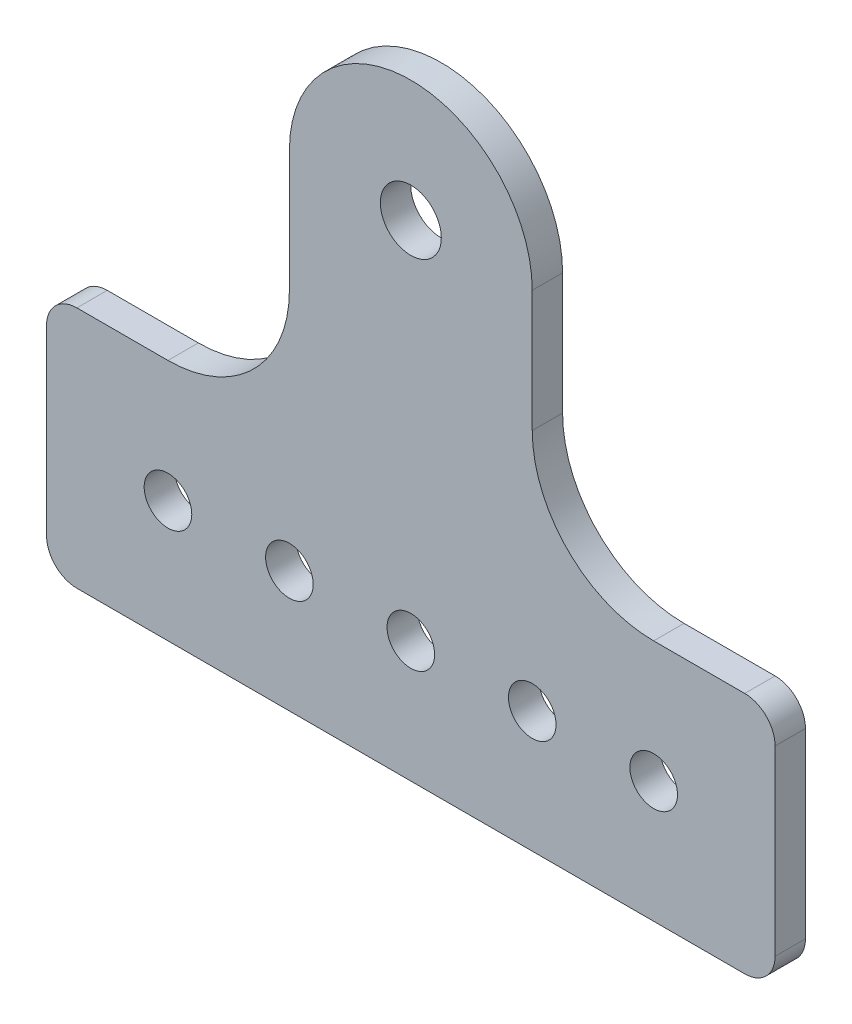
ISO-10303-21;
HEADER;
FILE_DESCRIPTION(('STEP AP214'),'2;1');
FILE_NAME('part.step','',(''),(''),'','','');
FILE_SCHEMA(('AUTOMOTIVE_DESIGN { 1 0 10303 214 1 1 1 1 }'));
ENDSEC;
DATA;
#1=APPLICATION_CONTEXT('core data for automotive mechanical design processes');
#2=APPLICATION_PROTOCOL_DEFINITION('international standard','automotive_design',2000,#1);
#3=PRODUCT_CONTEXT('',#1,'mechanical');
#4=PRODUCT('Part','Part','',(#3));
#5=PRODUCT_RELATED_PRODUCT_CATEGORY('part','',(#4));
#6=PRODUCT_DEFINITION_FORMATION('','',#4);
#7=PRODUCT_DEFINITION_CONTEXT('part definition',#1,'design');
#8=PRODUCT_DEFINITION('design','',#6,#7);
#9=PRODUCT_DEFINITION_SHAPE('','',#8);
#10=(LENGTH_UNIT() NAMED_UNIT(*) SI_UNIT(.MILLI.,.METRE.));
#11=(NAMED_UNIT(*) PLANE_ANGLE_UNIT() SI_UNIT($,.RADIAN.));
#12=(NAMED_UNIT(*) SI_UNIT($,.STERADIAN.) SOLID_ANGLE_UNIT());
#13=UNCERTAINTY_MEASURE_WITH_UNIT(LENGTH_MEASURE(1.E-05),#10,'distance_accuracy_value','');
#14=(GEOMETRIC_REPRESENTATION_CONTEXT(3) GLOBAL_UNCERTAINTY_ASSIGNED_CONTEXT((#13)) GLOBAL_UNIT_ASSIGNED_CONTEXT((#10,
#11,#12)) REPRESENTATION_CONTEXT('',''));
#15=CARTESIAN_POINT('',(0.,0.,0.));
#16=DIRECTION('',(0.,0.,1.));
#17=DIRECTION('',(1.,0.,0.));
#18=AXIS2_PLACEMENT_3D('',#15,#16,#17);
#19=CARTESIAN_POINT('',(0.,24.8227272727273,3.175));
#20=DIRECTION('',(0.,0.,1.));
#21=DIRECTION('',(1.,0.,0.));
#22=AXIS2_PLACEMENT_3D('',#19,#20,#21);
#23=PLANE('',#22);
#24=CARTESIAN_POINT('',(0.,50.8,3.175));
#25=DIRECTION('',(0.,0.,1.));
#26=DIRECTION('',(1.,0.,0.));
#27=AXIS2_PLACEMENT_3D('',#24,#25,#26);
#28=CIRCLE('',#27,3.1877);
#29=CARTESIAN_POINT('',(3.18769999999999,50.8,3.175));
#30=VERTEX_POINT('',#29);
#31=EDGE_CURVE('E201',#30,#30,#28,.F.);
#32=ORIENTED_EDGE('',*,*,#31,.T.);
#33=EDGE_LOOP('',(#32));
#34=FACE_BOUND('',#33,.T.);
#35=CARTESIAN_POINT('',(25.4,12.7,3.175));
#36=DIRECTION('',(0.,0.,1.));
#37=DIRECTION('',(1.,0.,0.));
#38=AXIS2_PLACEMENT_3D('',#35,#36,#37);
#39=CIRCLE('',#38,2.4892);
#40=CARTESIAN_POINT('',(27.8892,12.7,3.175));
#41=VERTEX_POINT('',#40);
#42=EDGE_CURVE('E204',#41,#41,#39,.F.);
#43=ORIENTED_EDGE('',*,*,#42,.T.);
#44=EDGE_LOOP('',(#43));
#45=FACE_BOUND('',#44,.T.);
#46=CARTESIAN_POINT('',(0.,12.7,3.175));
#47=DIRECTION('',(0.,0.,1.));
#48=DIRECTION('',(1.,0.,0.));
#49=AXIS2_PLACEMENT_3D('',#46,#47,#48);
#50=CIRCLE('',#49,2.4892);
#51=CARTESIAN_POINT('',(2.4892,12.7,3.175));
#52=VERTEX_POINT('',#51);
#53=EDGE_CURVE('E207',#52,#52,#50,.F.);
#54=ORIENTED_EDGE('',*,*,#53,.T.);
#55=EDGE_LOOP('',(#54));
#56=FACE_BOUND('',#55,.T.);
#57=CARTESIAN_POINT('',(-25.4,12.7,3.175));
#58=DIRECTION('',(0.,0.,1.));
#59=DIRECTION('',(1.,0.,0.));
#60=AXIS2_PLACEMENT_3D('',#57,#58,#59);
#61=CIRCLE('',#60,2.4892);
#62=CARTESIAN_POINT('',(-22.9108,12.7,3.175));
#63=VERTEX_POINT('',#62);
#64=EDGE_CURVE('E210',#63,#63,#61,.F.);
#65=ORIENTED_EDGE('',*,*,#64,.T.);
#66=EDGE_LOOP('',(#65));
#67=FACE_BOUND('',#66,.T.);
#68=CARTESIAN_POINT('',(-12.7,12.7,3.175));
#69=DIRECTION('',(0.,0.,1.));
#70=DIRECTION('',(1.,0.,0.));
#71=AXIS2_PLACEMENT_3D('',#68,#69,#70);
#72=CIRCLE('',#71,2.4892);
#73=CARTESIAN_POINT('',(-10.2108,12.7,3.175));
#74=VERTEX_POINT('',#73);
#75=EDGE_CURVE('E213',#74,#74,#72,.F.);
#76=ORIENTED_EDGE('',*,*,#75,.T.);
#77=EDGE_LOOP('',(#76));
#78=FACE_BOUND('',#77,.T.);
#79=CARTESIAN_POINT('',(12.7,12.7,3.175));
#80=DIRECTION('',(0.,0.,1.));
#81=DIRECTION('',(1.,0.,0.));
#82=AXIS2_PLACEMENT_3D('',#79,#80,#81);
#83=CIRCLE('',#82,2.4892);
#84=CARTESIAN_POINT('',(15.1892,12.7,3.175));
#85=VERTEX_POINT('',#84);
#86=EDGE_CURVE('E216',#85,#85,#83,.F.);
#87=ORIENTED_EDGE('',*,*,#86,.T.);
#88=EDGE_LOOP('',(#87));
#89=FACE_BOUND('',#88,.T.);
#90=CARTESIAN_POINT('',(25.4,38.1,3.175));
#91=DIRECTION('',(0.,0.,1.));
#92=DIRECTION('',(1.,0.,0.));
#93=AXIS2_PLACEMENT_3D('',#90,#91,#92);
#94=CIRCLE('',#93,12.7);
#95=CARTESIAN_POINT('',(25.4,25.4,3.175));
#96=VERTEX_POINT('',#95);
#97=CARTESIAN_POINT('',(12.7,38.1,3.175));
#98=VERTEX_POINT('',#97);
#99=EDGE_CURVE('E221',#96,#98,#94,.F.);
#100=ORIENTED_EDGE('',*,*,#99,.T.);
#101=DIRECTION('',(0.,1.,0.));
#102=VECTOR('',#101,1.);
#103=CARTESIAN_POINT('',(12.7,25.4,3.175));
#104=LINE('',#103,#102);
#105=CARTESIAN_POINT('',(12.7,50.8,3.175));
#106=VERTEX_POINT('',#105);
#107=EDGE_CURVE('E142',#106,#98,#104,.F.);
#108=ORIENTED_EDGE('',*,*,#107,.F.);
#109=CARTESIAN_POINT('',(0.,50.8,3.175));
#110=DIRECTION('',(0.,0.,1.));
#111=DIRECTION('',(1.,0.,0.));
#112=AXIS2_PLACEMENT_3D('',#109,#110,#111);
#113=CIRCLE('',#112,12.7);
#114=CARTESIAN_POINT('',(-12.7,50.8,3.175));
#115=VERTEX_POINT('',#114);
#116=EDGE_CURVE('E145',#115,#106,#113,.F.);
#117=ORIENTED_EDGE('',*,*,#116,.F.);
#118=DIRECTION('',(0.,-1.,0.));
#119=VECTOR('',#118,1.);
#120=CARTESIAN_POINT('',(-12.7,63.5,3.175));
#121=LINE('',#120,#119);
#122=CARTESIAN_POINT('',(-12.7,38.1,3.175));
#123=VERTEX_POINT('',#122);
#124=EDGE_CURVE('E113',#123,#115,#121,.F.);
#125=ORIENTED_EDGE('',*,*,#124,.F.);
#126=CARTESIAN_POINT('',(-25.4,38.1,3.175));
#127=DIRECTION('',(0.,0.,1.));
#128=DIRECTION('',(1.,0.,0.));
#129=AXIS2_PLACEMENT_3D('',#126,#127,#128);
#130=CIRCLE('',#129,12.7);
#131=CARTESIAN_POINT('',(-25.4,25.4,3.175));
#132=VERTEX_POINT('',#131);
#133=EDGE_CURVE('E18',#123,#132,#130,.F.);
#134=ORIENTED_EDGE('',*,*,#133,.T.);
#135=DIRECTION('',(-1.,0.,0.));
#136=VECTOR('',#135,1.);
#137=CARTESIAN_POINT('',(-12.7,25.4,3.175));
#138=LINE('',#137,#136);
#139=CARTESIAN_POINT('',(-34.925,25.4,3.175));
#140=VERTEX_POINT('',#139);
#141=EDGE_CURVE('E118',#140,#132,#138,.F.);
#142=ORIENTED_EDGE('',*,*,#141,.F.);
#143=CARTESIAN_POINT('',(-34.925,22.225,3.175));
#144=DIRECTION('',(0.,0.,1.));
#145=DIRECTION('',(1.,0.,0.));
#146=AXIS2_PLACEMENT_3D('',#143,#144,#145);
#147=CIRCLE('',#146,3.175);
#148=CARTESIAN_POINT('',(-38.1,22.225,3.175));
#149=VERTEX_POINT('',#148);
#150=EDGE_CURVE('E130',#149,#140,#147,.F.);
#151=ORIENTED_EDGE('',*,*,#150,.F.);
#152=DIRECTION('',(0.,-1.,0.));
#153=VECTOR('',#152,1.);
#154=CARTESIAN_POINT('',(-38.1,25.4,3.175));
#155=LINE('',#154,#153);
#156=CARTESIAN_POINT('',(-38.1,3.175,3.175));
#157=VERTEX_POINT('',#156);
#158=EDGE_CURVE('E159',#157,#149,#155,.F.);
#159=ORIENTED_EDGE('',*,*,#158,.F.);
#160=CARTESIAN_POINT('',(-34.925,3.175,3.175));
#161=DIRECTION('',(0.,0.,1.));
#162=DIRECTION('',(1.,0.,0.));
#163=AXIS2_PLACEMENT_3D('',#160,#161,#162);
#164=CIRCLE('',#163,3.175);
#165=CARTESIAN_POINT('',(-34.925,0.,3.175));
#166=VERTEX_POINT('',#165);
#167=EDGE_CURVE('E228',#166,#157,#164,.F.);
#168=ORIENTED_EDGE('',*,*,#167,.F.);
#169=DIRECTION('',(1.,0.,0.));
#170=VECTOR('',#169,1.);
#171=CARTESIAN_POINT('',(-38.1,0.,3.175));
#172=LINE('',#171,#170);
#173=CARTESIAN_POINT('',(34.925,0.,3.175));
#174=VERTEX_POINT('',#173);
#175=EDGE_CURVE('E155',#174,#166,#172,.F.);
#176=ORIENTED_EDGE('',*,*,#175,.F.);
#177=CARTESIAN_POINT('',(34.925,3.17500000000003,3.175));
#178=DIRECTION('',(0.,0.,1.));
#179=DIRECTION('',(1.,0.,0.));
#180=AXIS2_PLACEMENT_3D('',#177,#178,#179);
#181=CIRCLE('',#180,3.175);
#182=CARTESIAN_POINT('',(38.1,3.17500000000003,3.175));
#183=VERTEX_POINT('',#182);
#184=EDGE_CURVE('E226',#183,#174,#181,.F.);
#185=ORIENTED_EDGE('',*,*,#184,.F.);
#186=DIRECTION('',(0.,1.,0.));
#187=VECTOR('',#186,1.);
#188=CARTESIAN_POINT('',(38.1,0.,3.175));
#189=LINE('',#188,#187);
#190=CARTESIAN_POINT('',(38.1,22.225,3.175));
#191=VERTEX_POINT('',#190);
#192=EDGE_CURVE('E151',#191,#183,#189,.F.);
#193=ORIENTED_EDGE('',*,*,#192,.F.);
#194=CARTESIAN_POINT('',(34.925,22.225,3.175));
#195=DIRECTION('',(0.,0.,1.));
#196=DIRECTION('',(1.,0.,0.));
#197=AXIS2_PLACEMENT_3D('',#194,#195,#196);
#198=CIRCLE('',#197,3.175);
#199=CARTESIAN_POINT('',(34.925,25.4,3.175));
#200=VERTEX_POINT('',#199);
#201=EDGE_CURVE('E224',#200,#191,#198,.F.);
#202=ORIENTED_EDGE('',*,*,#201,.F.);
#203=DIRECTION('',(-1.,0.,0.));
#204=VECTOR('',#203,1.);
#205=CARTESIAN_POINT('',(38.1,25.4,3.175));
#206=LINE('',#205,#204);
#207=EDGE_CURVE('E147',#96,#200,#206,.F.);
#208=ORIENTED_EDGE('',*,*,#207,.F.);
#209=EDGE_LOOP('',(#100,#108,#117,#125,#134,#142,#151,#159,#168,#176,#185,#193,#202,#208));
#210=FACE_BOUND('',#209,.T.);
#211=ADVANCED_FACE('F15',(#34,#45,#56,#67,#78,#89,#210),#23,.T.);
#212=CARTESIAN_POINT('',(-12.7,63.5,0.));
#213=DIRECTION('',(-1.,0.,0.));
#214=DIRECTION('',(0.,-1.,0.));
#215=AXIS2_PLACEMENT_3D('',#212,#213,#214);
#216=PLANE('',#215);
#217=DIRECTION('',(0.,0.,1.));
#218=VECTOR('',#217,1.);
#219=CARTESIAN_POINT('',(-12.7,50.8,0.));
#220=LINE('',#219,#218);
#221=CARTESIAN_POINT('',(-12.7,50.8,0.));
#222=VERTEX_POINT('',#221);
#223=EDGE_CURVE('E219',#222,#115,#220,.T.);
#224=ORIENTED_EDGE('',*,*,#223,.F.);
#225=DIRECTION('',(0.,1.,0.));
#226=VECTOR('',#225,1.);
#227=CARTESIAN_POINT('',(-12.7,24.8227272727273,0.));
#228=LINE('',#227,#226);
#229=CARTESIAN_POINT('',(-12.7,38.1,0.));
#230=VERTEX_POINT('',#229);
#231=EDGE_CURVE('E200',#222,#230,#228,.F.);
#232=ORIENTED_EDGE('',*,*,#231,.T.);
#233=DIRECTION('',(0.,0.,1.));
#234=VECTOR('',#233,1.);
#235=CARTESIAN_POINT('',(-12.7,38.1,0.));
#236=LINE('',#235,#234);
#237=EDGE_CURVE('E124',#230,#123,#236,.T.);
#238=ORIENTED_EDGE('',*,*,#237,.T.);
#239=ORIENTED_EDGE('',*,*,#124,.T.);
#240=EDGE_LOOP('',(#224,#232,#238,#239));
#241=FACE_BOUND('',#240,.T.);
#242=ADVANCED_FACE('F305',(#241),#216,.T.);
#243=CARTESIAN_POINT('',(-25.4,38.1,0.));
#244=DIRECTION('',(0.,0.,1.));
#245=DIRECTION('',(1.,0.,0.));
#246=AXIS2_PLACEMENT_3D('',#243,#244,#245);
#247=CYLINDRICAL_SURFACE('',#246,12.7);
#248=DIRECTION('',(0.,0.,1.));
#249=VECTOR('',#248,1.);
#250=CARTESIAN_POINT('',(-25.4,25.4,0.));
#251=LINE('',#250,#249);
#252=CARTESIAN_POINT('',(-25.4,25.4,0.));
#253=VERTEX_POINT('',#252);
#254=EDGE_CURVE('E123',#132,#253,#251,.F.);
#255=ORIENTED_EDGE('',*,*,#254,.F.);
#256=ORIENTED_EDGE('',*,*,#133,.F.);
#257=ORIENTED_EDGE('',*,*,#237,.F.);
#258=CARTESIAN_POINT('',(-25.4,38.1,0.));
#259=DIRECTION('',(0.,0.,1.));
#260=DIRECTION('',(1.,0.,0.));
#261=AXIS2_PLACEMENT_3D('',#258,#259,#260);
#262=CIRCLE('',#261,12.7);
#263=EDGE_CURVE('E135',#230,#253,#262,.F.);
#264=ORIENTED_EDGE('',*,*,#263,.T.);
#265=EDGE_LOOP('',(#255,#256,#257,#264));
#266=FACE_BOUND('',#265,.T.);
#267=ADVANCED_FACE('F133',(#266),#247,.F.);
#268=CARTESIAN_POINT('',(-12.7,25.4,0.));
#269=DIRECTION('',(0.,1.,0.));
#270=DIRECTION('',(-1.,0.,0.));
#271=AXIS2_PLACEMENT_3D('',#268,#269,#270);
#272=PLANE('',#271);
#273=DIRECTION('',(0.,0.,1.));
#274=VECTOR('',#273,1.);
#275=CARTESIAN_POINT('',(-34.925,25.4,0.));
#276=LINE('',#275,#274);
#277=CARTESIAN_POINT('',(-34.925,25.4,0.));
#278=VERTEX_POINT('',#277);
#279=EDGE_CURVE('E129',#140,#278,#276,.F.);
#280=ORIENTED_EDGE('',*,*,#279,.F.);
#281=ORIENTED_EDGE('',*,*,#141,.T.);
#282=ORIENTED_EDGE('',*,*,#254,.T.);
#283=DIRECTION('',(1.,0.,0.));
#284=VECTOR('',#283,1.);
#285=CARTESIAN_POINT('',(0.,25.4,0.));
#286=LINE('',#285,#284);
#287=EDGE_CURVE('E198',#253,#278,#286,.F.);
#288=ORIENTED_EDGE('',*,*,#287,.T.);
#289=EDGE_LOOP('',(#280,#281,#282,#288));
#290=FACE_BOUND('',#289,.T.);
#291=ADVANCED_FACE('F126',(#290),#272,.T.);
#292=CARTESIAN_POINT('',(-34.925,22.225,0.));
#293=DIRECTION('',(0.,0.,1.));
#294=DIRECTION('',(1.,0.,0.));
#295=AXIS2_PLACEMENT_3D('',#292,#293,#294);
#296=CYLINDRICAL_SURFACE('',#295,3.175);
#297=CARTESIAN_POINT('',(-34.925,22.225,0.));
#298=DIRECTION('',(0.,0.,1.));
#299=DIRECTION('',(1.,0.,0.));
#300=AXIS2_PLACEMENT_3D('',#297,#298,#299);
#301=CIRCLE('',#300,3.175);
#302=CARTESIAN_POINT('',(-38.1,22.225,0.));
#303=VERTEX_POINT('',#302);
#304=EDGE_CURVE('E195',#278,#303,#301,.T.);
#305=ORIENTED_EDGE('',*,*,#304,.T.);
#306=DIRECTION('',(0.,0.,1.));
#307=VECTOR('',#306,1.);
#308=CARTESIAN_POINT('',(-38.1,22.225,0.));
#309=LINE('',#308,#307);
#310=EDGE_CURVE('E160',#149,#303,#309,.F.);
#311=ORIENTED_EDGE('',*,*,#310,.F.);
#312=ORIENTED_EDGE('',*,*,#150,.T.);
#313=ORIENTED_EDGE('',*,*,#279,.T.);
#314=EDGE_LOOP('',(#305,#311,#312,#313));
#315=FACE_BOUND('',#314,.T.);
#316=ADVANCED_FACE('F232',(#315),#296,.T.);
#317=CARTESIAN_POINT('',(-38.1,25.4,0.));
#318=DIRECTION('',(-1.,0.,0.));
#319=DIRECTION('',(0.,-1.,0.));
#320=AXIS2_PLACEMENT_3D('',#317,#318,#319);
#321=PLANE('',#320);
#322=ORIENTED_EDGE('',*,*,#310,.T.);
#323=DIRECTION('',(0.,1.,0.));
#324=VECTOR('',#323,1.);
#325=CARTESIAN_POINT('',(-38.1,24.8227272727273,0.));
#326=LINE('',#325,#324);
#327=CARTESIAN_POINT('',(-38.1,3.175,0.));
#328=VERTEX_POINT('',#327);
#329=EDGE_CURVE('E194',#303,#328,#326,.F.);
#330=ORIENTED_EDGE('',*,*,#329,.T.);
#331=DIRECTION('',(0.,0.,1.));
#332=VECTOR('',#331,1.);
#333=CARTESIAN_POINT('',(-38.1,3.175,0.));
#334=LINE('',#333,#332);
#335=EDGE_CURVE('E158',#157,#328,#334,.F.);
#336=ORIENTED_EDGE('',*,*,#335,.F.);
#337=ORIENTED_EDGE('',*,*,#158,.T.);
#338=EDGE_LOOP('',(#322,#330,#336,#337));
#339=FACE_BOUND('',#338,.T.);
#340=ADVANCED_FACE('F257',(#339),#321,.T.);
#341=CARTESIAN_POINT('',(-34.925,3.175,0.));
#342=DIRECTION('',(0.,0.,1.));
#343=DIRECTION('',(1.,0.,0.));
#344=AXIS2_PLACEMENT_3D('',#341,#342,#343);
#345=CYLINDRICAL_SURFACE('',#344,3.175);
#346=CARTESIAN_POINT('',(-34.925,3.175,0.));
#347=DIRECTION('',(0.,0.,1.));
#348=DIRECTION('',(1.,0.,0.));
#349=AXIS2_PLACEMENT_3D('',#346,#347,#348);
#350=CIRCLE('',#349,3.175);
#351=CARTESIAN_POINT('',(-34.925,0.,0.));
#352=VERTEX_POINT('',#351);
#353=EDGE_CURVE('E191',#328,#352,#350,.T.);
#354=ORIENTED_EDGE('',*,*,#353,.T.);
#355=DIRECTION('',(0.,0.,1.));
#356=VECTOR('',#355,1.);
#357=CARTESIAN_POINT('',(-34.925,0.,0.));
#358=LINE('',#357,#356);
#359=EDGE_CURVE('E157',#166,#352,#358,.F.);
#360=ORIENTED_EDGE('',*,*,#359,.F.);
#361=ORIENTED_EDGE('',*,*,#167,.T.);
#362=ORIENTED_EDGE('',*,*,#335,.T.);
#363=EDGE_LOOP('',(#354,#360,#361,#362));
#364=FACE_BOUND('',#363,.T.);
#365=ADVANCED_FACE('F266',(#364),#345,.T.);
#366=CARTESIAN_POINT('',(-38.1,0.,0.));
#367=DIRECTION('',(0.,-1.,0.));
#368=DIRECTION('',(1.,0.,0.));
#369=AXIS2_PLACEMENT_3D('',#366,#367,#368);
#370=PLANE('',#369);
#371=ORIENTED_EDGE('',*,*,#359,.T.);
#372=DIRECTION('',(1.,0.,0.));
#373=VECTOR('',#372,1.);
#374=CARTESIAN_POINT('',(0.,0.,0.));
#375=LINE('',#374,#373);
#376=CARTESIAN_POINT('',(34.925,0.,0.));
#377=VERTEX_POINT('',#376);
#378=EDGE_CURVE('E190',#352,#377,#375,.T.);
#379=ORIENTED_EDGE('',*,*,#378,.T.);
#380=DIRECTION('',(0.,0.,1.));
#381=VECTOR('',#380,1.);
#382=CARTESIAN_POINT('',(34.925,0.,0.));
#383=LINE('',#382,#381);
#384=EDGE_CURVE('E154',#174,#377,#383,.F.);
#385=ORIENTED_EDGE('',*,*,#384,.F.);
#386=ORIENTED_EDGE('',*,*,#175,.T.);
#387=EDGE_LOOP('',(#371,#379,#385,#386));
#388=FACE_BOUND('',#387,.T.);
#389=ADVANCED_FACE('F270',(#388),#370,.T.);
#390=CARTESIAN_POINT('',(34.925,3.17500000000003,0.));
#391=DIRECTION('',(0.,0.,1.));
#392=DIRECTION('',(1.,0.,0.));
#393=AXIS2_PLACEMENT_3D('',#390,#391,#392);
#394=CYLINDRICAL_SURFACE('',#393,3.175);
#395=CARTESIAN_POINT('',(34.925,3.17500000000003,0.));
#396=DIRECTION('',(0.,0.,1.));
#397=DIRECTION('',(1.,0.,0.));
#398=AXIS2_PLACEMENT_3D('',#395,#396,#397);
#399=CIRCLE('',#398,3.175);
#400=CARTESIAN_POINT('',(38.1,3.17500000000003,0.));
#401=VERTEX_POINT('',#400);
#402=EDGE_CURVE('E187',#377,#401,#399,.T.);
#403=ORIENTED_EDGE('',*,*,#402,.T.);
#404=DIRECTION('',(0.,0.,-1.));
#405=VECTOR('',#404,1.);
#406=CARTESIAN_POINT('',(38.1,3.17500000000003,0.));
#407=LINE('',#406,#405);
#408=EDGE_CURVE('E153',#183,#401,#407,.T.);
#409=ORIENTED_EDGE('',*,*,#408,.F.);
#410=ORIENTED_EDGE('',*,*,#184,.T.);
#411=ORIENTED_EDGE('',*,*,#384,.T.);
#412=EDGE_LOOP('',(#403,#409,#410,#411));
#413=FACE_BOUND('',#412,.T.);
#414=ADVANCED_FACE('F300',(#413),#394,.T.);
#415=CARTESIAN_POINT('',(38.1,0.,0.));
#416=DIRECTION('',(1.,0.,0.));
#417=DIRECTION('',(0.,0.,-1.));
#418=AXIS2_PLACEMENT_3D('',#415,#416,#417);
#419=PLANE('',#418);
#420=ORIENTED_EDGE('',*,*,#408,.T.);
#421=DIRECTION('',(0.,1.,0.));
#422=VECTOR('',#421,1.);
#423=CARTESIAN_POINT('',(38.1,24.8227272727273,0.));
#424=LINE('',#423,#422);
#425=CARTESIAN_POINT('',(38.1,22.225,0.));
#426=VERTEX_POINT('',#425);
#427=EDGE_CURVE('E186',#401,#426,#424,.T.);
#428=ORIENTED_EDGE('',*,*,#427,.T.);
#429=DIRECTION('',(0.,0.,1.));
#430=VECTOR('',#429,1.);
#431=CARTESIAN_POINT('',(38.1,22.225,0.));
#432=LINE('',#431,#430);
#433=EDGE_CURVE('E150',#191,#426,#432,.F.);
#434=ORIENTED_EDGE('',*,*,#433,.F.);
#435=ORIENTED_EDGE('',*,*,#192,.T.);
#436=EDGE_LOOP('',(#420,#428,#434,#435));
#437=FACE_BOUND('',#436,.T.);
#438=ADVANCED_FACE('F297',(#437),#419,.T.);
#439=CARTESIAN_POINT('',(34.925,22.225,0.));
#440=DIRECTION('',(0.,0.,1.));
#441=DIRECTION('',(1.,0.,0.));
#442=AXIS2_PLACEMENT_3D('',#439,#440,#441);
#443=CYLINDRICAL_SURFACE('',#442,3.175);
#444=CARTESIAN_POINT('',(34.925,22.225,0.));
#445=DIRECTION('',(0.,0.,1.));
#446=DIRECTION('',(1.,0.,0.));
#447=AXIS2_PLACEMENT_3D('',#444,#445,#446);
#448=CIRCLE('',#447,3.175);
#449=CARTESIAN_POINT('',(34.925,25.4,0.));
#450=VERTEX_POINT('',#449);
#451=EDGE_CURVE('E183',#426,#450,#448,.T.);
#452=ORIENTED_EDGE('',*,*,#451,.T.);
#453=DIRECTION('',(0.,0.,1.));
#454=VECTOR('',#453,1.);
#455=CARTESIAN_POINT('',(34.925,25.4,0.));
#456=LINE('',#455,#454);
#457=EDGE_CURVE('E149',#200,#450,#456,.F.);
#458=ORIENTED_EDGE('',*,*,#457,.F.);
#459=ORIENTED_EDGE('',*,*,#201,.T.);
#460=ORIENTED_EDGE('',*,*,#433,.T.);
#461=EDGE_LOOP('',(#452,#458,#459,#460));
#462=FACE_BOUND('',#461,.T.);
#463=ADVANCED_FACE('F293',(#462),#443,.T.);
#464=CARTESIAN_POINT('',(38.1,25.4,0.));
#465=DIRECTION('',(0.,1.,0.));
#466=DIRECTION('',(-1.,0.,0.));
#467=AXIS2_PLACEMENT_3D('',#464,#465,#466);
#468=PLANE('',#467);
#469=ORIENTED_EDGE('',*,*,#457,.T.);
#470=DIRECTION('',(1.,0.,0.));
#471=VECTOR('',#470,1.);
#472=CARTESIAN_POINT('',(0.,25.4,0.));
#473=LINE('',#472,#471);
#474=CARTESIAN_POINT('',(25.4,25.4,0.));
#475=VERTEX_POINT('',#474);
#476=EDGE_CURVE('E182',#450,#475,#473,.F.);
#477=ORIENTED_EDGE('',*,*,#476,.T.);
#478=DIRECTION('',(0.,0.,1.));
#479=VECTOR('',#478,1.);
#480=CARTESIAN_POINT('',(25.4,25.4,0.));
#481=LINE('',#480,#479);
#482=EDGE_CURVE('E223',#475,#96,#481,.T.);
#483=ORIENTED_EDGE('',*,*,#482,.T.);
#484=ORIENTED_EDGE('',*,*,#207,.T.);
#485=EDGE_LOOP('',(#469,#477,#483,#484));
#486=FACE_BOUND('',#485,.T.);
#487=ADVANCED_FACE('F288',(#486),#468,.T.);
#488=CARTESIAN_POINT('',(25.4,38.1,0.));
#489=DIRECTION('',(0.,0.,1.));
#490=DIRECTION('',(1.,0.,0.));
#491=AXIS2_PLACEMENT_3D('',#488,#489,#490);
#492=CYLINDRICAL_SURFACE('',#491,12.7);
#493=DIRECTION('',(0.,0.,1.));
#494=VECTOR('',#493,1.);
#495=CARTESIAN_POINT('',(12.7,38.1,0.));
#496=LINE('',#495,#494);
#497=CARTESIAN_POINT('',(12.7,38.1,0.));
#498=VERTEX_POINT('',#497);
#499=EDGE_CURVE('E146',#98,#498,#496,.F.);
#500=ORIENTED_EDGE('',*,*,#499,.F.);
#501=ORIENTED_EDGE('',*,*,#99,.F.);
#502=ORIENTED_EDGE('',*,*,#482,.F.);
#503=CARTESIAN_POINT('',(25.4,38.1,0.));
#504=DIRECTION('',(0.,0.,1.));
#505=DIRECTION('',(1.,0.,0.));
#506=AXIS2_PLACEMENT_3D('',#503,#504,#505);
#507=CIRCLE('',#506,12.7);
#508=EDGE_CURVE('E179',#475,#498,#507,.F.);
#509=ORIENTED_EDGE('',*,*,#508,.T.);
#510=EDGE_LOOP('',(#500,#501,#502,#509));
#511=FACE_BOUND('',#510,.T.);
#512=ADVANCED_FACE('F285',(#511),#492,.F.);
#513=CARTESIAN_POINT('',(12.7,25.4,0.));
#514=DIRECTION('',(1.,0.,0.));
#515=DIRECTION('',(0.,1.,0.));
#516=AXIS2_PLACEMENT_3D('',#513,#514,#515);
#517=PLANE('',#516);
#518=DIRECTION('',(0.,0.,1.));
#519=VECTOR('',#518,1.);
#520=CARTESIAN_POINT('',(12.7,50.8,0.));
#521=LINE('',#520,#519);
#522=CARTESIAN_POINT('',(12.7,50.8,0.));
#523=VERTEX_POINT('',#522);
#524=EDGE_CURVE('E33',#106,#523,#521,.F.);
#525=ORIENTED_EDGE('',*,*,#524,.F.);
#526=ORIENTED_EDGE('',*,*,#107,.T.);
#527=ORIENTED_EDGE('',*,*,#499,.T.);
#528=DIRECTION('',(0.,1.,0.));
#529=VECTOR('',#528,1.);
#530=CARTESIAN_POINT('',(12.7,24.8227272727273,0.));
#531=LINE('',#530,#529);
#532=EDGE_CURVE('E178',#498,#523,#531,.T.);
#533=ORIENTED_EDGE('',*,*,#532,.T.);
#534=EDGE_LOOP('',(#525,#526,#527,#533));
#535=FACE_BOUND('',#534,.T.);
#536=ADVANCED_FACE('F280',(#535),#517,.T.);
#537=CARTESIAN_POINT('',(0.,50.8,0.));
#538=DIRECTION('',(0.,0.,1.));
#539=DIRECTION('',(1.,0.,0.));
#540=AXIS2_PLACEMENT_3D('',#537,#538,#539);
#541=CYLINDRICAL_SURFACE('',#540,12.7);
#542=CARTESIAN_POINT('',(0.,50.8,0.));
#543=DIRECTION('',(0.,0.,1.));
#544=DIRECTION('',(1.,0.,0.));
#545=AXIS2_PLACEMENT_3D('',#542,#543,#544);
#546=CIRCLE('',#545,12.7);
#547=EDGE_CURVE('E176',#523,#222,#546,.T.);
#548=ORIENTED_EDGE('',*,*,#547,.T.);
#549=ORIENTED_EDGE('',*,*,#223,.T.);
#550=ORIENTED_EDGE('',*,*,#116,.T.);
#551=ORIENTED_EDGE('',*,*,#524,.T.);
#552=EDGE_LOOP('',(#548,#549,#550,#551));
#553=FACE_BOUND('',#552,.T.);
#554=ADVANCED_FACE('F302',(#553),#541,.T.);
#555=CARTESIAN_POINT('',(12.7,12.7,-96.0659725113575));
#556=DIRECTION('',(0.,0.,1.));
#557=DIRECTION('',(1.,0.,0.));
#558=AXIS2_PLACEMENT_3D('',#555,#556,#557);
#559=CYLINDRICAL_SURFACE('',#558,2.4892);
#560=ORIENTED_EDGE('',*,*,#86,.F.);
#561=EDGE_LOOP('',(#560));
#562=FACE_BOUND('',#561,.T.);
#563=CARTESIAN_POINT('',(12.7,12.7,0.));
#564=DIRECTION('',(0.,0.,1.));
#565=DIRECTION('',(1.,0.,0.));
#566=AXIS2_PLACEMENT_3D('',#563,#564,#565);
#567=CIRCLE('',#566,2.4892);
#568=CARTESIAN_POINT('',(15.1892,12.7,0.));
#569=VERTEX_POINT('',#568);
#570=EDGE_CURVE('E173',#569,#569,#567,.F.);
#571=ORIENTED_EDGE('',*,*,#570,.T.);
#572=EDGE_LOOP('',(#571));
#573=FACE_BOUND('',#572,.T.);
#574=ADVANCED_FACE('F341',(#562,#573),#559,.F.);
#575=CARTESIAN_POINT('',(-12.7,12.7,-96.0659725113575));
#576=DIRECTION('',(0.,0.,1.));
#577=DIRECTION('',(1.,0.,0.));
#578=AXIS2_PLACEMENT_3D('',#575,#576,#577);
#579=CYLINDRICAL_SURFACE('',#578,2.4892);
#580=ORIENTED_EDGE('',*,*,#75,.F.);
#581=EDGE_LOOP('',(#580));
#582=FACE_BOUND('',#581,.T.);
#583=CARTESIAN_POINT('',(-12.7,12.7,0.));
#584=DIRECTION('',(0.,0.,1.));
#585=DIRECTION('',(1.,0.,0.));
#586=AXIS2_PLACEMENT_3D('',#583,#584,#585);
#587=CIRCLE('',#586,2.4892);
#588=CARTESIAN_POINT('',(-10.2108,12.7,0.));
#589=VERTEX_POINT('',#588);
#590=EDGE_CURVE('E170',#589,#589,#587,.F.);
#591=ORIENTED_EDGE('',*,*,#590,.T.);
#592=EDGE_LOOP('',(#591));
#593=FACE_BOUND('',#592,.T.);
#594=ADVANCED_FACE('F337',(#582,#593),#579,.F.);
#595=CARTESIAN_POINT('',(-25.4,12.7,-96.0659725113575));
#596=DIRECTION('',(0.,0.,1.));
#597=DIRECTION('',(1.,0.,0.));
#598=AXIS2_PLACEMENT_3D('',#595,#596,#597);
#599=CYLINDRICAL_SURFACE('',#598,2.4892);
#600=ORIENTED_EDGE('',*,*,#64,.F.);
#601=EDGE_LOOP('',(#600));
#602=FACE_BOUND('',#601,.T.);
#603=CARTESIAN_POINT('',(-25.4,12.7,0.));
#604=DIRECTION('',(0.,0.,1.));
#605=DIRECTION('',(1.,0.,0.));
#606=AXIS2_PLACEMENT_3D('',#603,#604,#605);
#607=CIRCLE('',#606,2.4892);
#608=CARTESIAN_POINT('',(-22.9108,12.7,0.));
#609=VERTEX_POINT('',#608);
#610=EDGE_CURVE('E167',#609,#609,#607,.F.);
#611=ORIENTED_EDGE('',*,*,#610,.T.);
#612=EDGE_LOOP('',(#611));
#613=FACE_BOUND('',#612,.T.);
#614=ADVANCED_FACE('F333',(#602,#613),#599,.F.);
#615=CARTESIAN_POINT('',(0.,12.7,-96.0659725113575));
#616=DIRECTION('',(0.,0.,1.));
#617=DIRECTION('',(1.,0.,0.));
#618=AXIS2_PLACEMENT_3D('',#615,#616,#617);
#619=CYLINDRICAL_SURFACE('',#618,2.4892);
#620=ORIENTED_EDGE('',*,*,#53,.F.);
#621=EDGE_LOOP('',(#620));
#622=FACE_BOUND('',#621,.T.);
#623=CARTESIAN_POINT('',(0.,12.7,0.));
#624=DIRECTION('',(0.,0.,1.));
#625=DIRECTION('',(1.,0.,0.));
#626=AXIS2_PLACEMENT_3D('',#623,#624,#625);
#627=CIRCLE('',#626,2.4892);
#628=CARTESIAN_POINT('',(2.4892,12.7,0.));
#629=VERTEX_POINT('',#628);
#630=EDGE_CURVE('E164',#629,#629,#627,.F.);
#631=ORIENTED_EDGE('',*,*,#630,.T.);
#632=EDGE_LOOP('',(#631));
#633=FACE_BOUND('',#632,.T.);
#634=ADVANCED_FACE('F329',(#622,#633),#619,.F.);
#635=CARTESIAN_POINT('',(25.4,12.7,-96.0659725113575));
#636=DIRECTION('',(0.,0.,1.));
#637=DIRECTION('',(1.,0.,0.));
#638=AXIS2_PLACEMENT_3D('',#635,#636,#637);
#639=CYLINDRICAL_SURFACE('',#638,2.4892);
#640=ORIENTED_EDGE('',*,*,#42,.F.);
#641=EDGE_LOOP('',(#640));
#642=FACE_BOUND('',#641,.T.);
#643=CARTESIAN_POINT('',(25.4,12.7,0.));
#644=DIRECTION('',(0.,0.,1.));
#645=DIRECTION('',(1.,0.,0.));
#646=AXIS2_PLACEMENT_3D('',#643,#644,#645);
#647=CIRCLE('',#646,2.4892);
#648=CARTESIAN_POINT('',(27.8892,12.7,0.));
#649=VERTEX_POINT('',#648);
#650=EDGE_CURVE('E24',#649,#649,#647,.F.);
#651=ORIENTED_EDGE('',*,*,#650,.T.);
#652=EDGE_LOOP('',(#651));
#653=FACE_BOUND('',#652,.T.);
#654=ADVANCED_FACE('F321',(#642,#653),#639,.F.);
#655=CARTESIAN_POINT('',(0.,50.8,-96.0659725113575));
#656=DIRECTION('',(0.,0.,1.));
#657=DIRECTION('',(1.,0.,0.));
#658=AXIS2_PLACEMENT_3D('',#655,#656,#657);
#659=CYLINDRICAL_SURFACE('',#658,3.1877);
#660=ORIENTED_EDGE('',*,*,#31,.F.);
#661=EDGE_LOOP('',(#660));
#662=FACE_BOUND('',#661,.T.);
#663=CARTESIAN_POINT('',(0.,50.8,0.));
#664=DIRECTION('',(0.,0.,1.));
#665=DIRECTION('',(1.,0.,0.));
#666=AXIS2_PLACEMENT_3D('',#663,#664,#665);
#667=CIRCLE('',#666,3.1877);
#668=CARTESIAN_POINT('',(3.18769999999999,50.8,0.));
#669=VERTEX_POINT('',#668);
#670=EDGE_CURVE('E9',#669,#669,#667,.F.);
#671=ORIENTED_EDGE('',*,*,#670,.T.);
#672=EDGE_LOOP('',(#671));
#673=FACE_BOUND('',#672,.T.);
#674=ADVANCED_FACE('F315',(#662,#673),#659,.F.);
#675=CARTESIAN_POINT('',(0.,24.8227272727273,0.));
#676=DIRECTION('',(0.,0.,1.));
#677=DIRECTION('',(1.,0.,0.));
#678=AXIS2_PLACEMENT_3D('',#675,#676,#677);
#679=PLANE('',#678);
#680=ORIENTED_EDGE('',*,*,#670,.F.);
#681=EDGE_LOOP('',(#680));
#682=FACE_BOUND('',#681,.T.);
#683=ORIENTED_EDGE('',*,*,#650,.F.);
#684=EDGE_LOOP('',(#683));
#685=FACE_BOUND('',#684,.T.);
#686=ORIENTED_EDGE('',*,*,#630,.F.);
#687=EDGE_LOOP('',(#686));
#688=FACE_BOUND('',#687,.T.);
#689=ORIENTED_EDGE('',*,*,#610,.F.);
#690=EDGE_LOOP('',(#689));
#691=FACE_BOUND('',#690,.T.);
#692=ORIENTED_EDGE('',*,*,#590,.F.);
#693=EDGE_LOOP('',(#692));
#694=FACE_BOUND('',#693,.T.);
#695=ORIENTED_EDGE('',*,*,#570,.F.);
#696=EDGE_LOOP('',(#695));
#697=FACE_BOUND('',#696,.T.);
#698=ORIENTED_EDGE('',*,*,#532,.F.);
#699=ORIENTED_EDGE('',*,*,#508,.F.);
#700=ORIENTED_EDGE('',*,*,#476,.F.);
#701=ORIENTED_EDGE('',*,*,#451,.F.);
#702=ORIENTED_EDGE('',*,*,#427,.F.);
#703=ORIENTED_EDGE('',*,*,#402,.F.);
#704=ORIENTED_EDGE('',*,*,#378,.F.);
#705=ORIENTED_EDGE('',*,*,#353,.F.);
#706=ORIENTED_EDGE('',*,*,#329,.F.);
#707=ORIENTED_EDGE('',*,*,#304,.F.);
#708=ORIENTED_EDGE('',*,*,#287,.F.);
#709=ORIENTED_EDGE('',*,*,#263,.F.);
#710=ORIENTED_EDGE('',*,*,#231,.F.);
#711=ORIENTED_EDGE('',*,*,#547,.F.);
#712=EDGE_LOOP('',(#698,#699,#700,#701,#702,#703,#704,#705,#706,#707,#708,#709,#710,#711));
#713=FACE_BOUND('',#712,.T.);
#714=ADVANCED_FACE('F236',(#682,#685,#688,#691,#694,#697,#713),#679,.F.);
#715=CLOSED_SHELL('',(#211,#242,#267,#291,#316,#340,#365,#389,#414,#438,#463,#487,#512,#536,
#554,#574,#594,#614,#634,#654,#674,#714));
#716=MANIFOLD_SOLID_BREP('B1',#715);
#717=ADVANCED_BREP_SHAPE_REPRESENTATION('',(#18,#716),#14);
#718=SHAPE_DEFINITION_REPRESENTATION(#9,#717);
ENDSEC;
END-ISO-10303-21;
